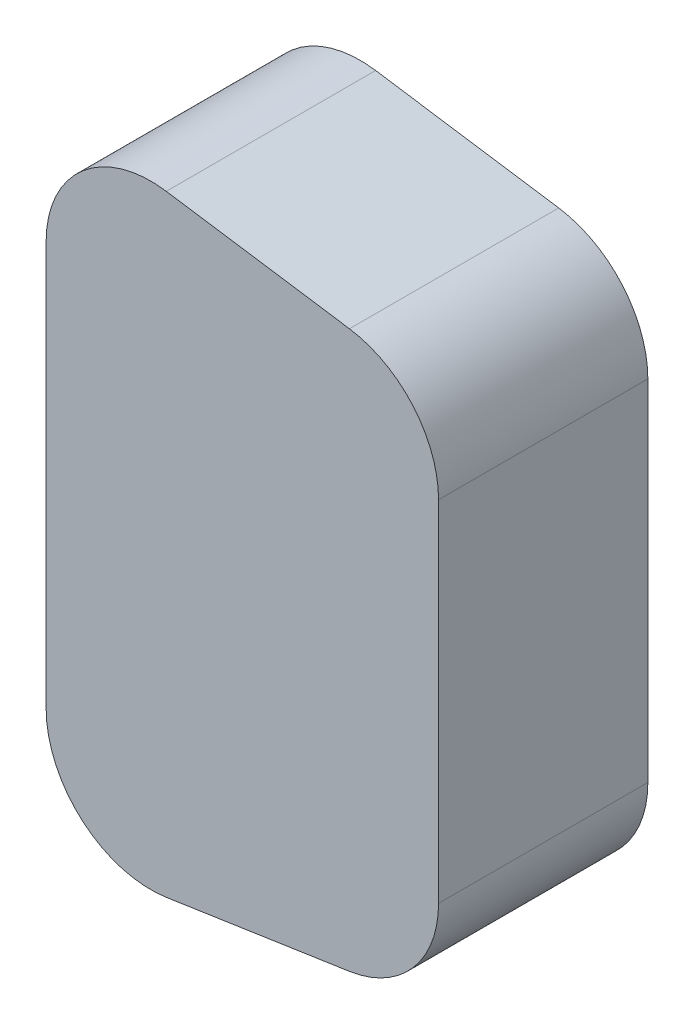
ISO-10303-21;
HEADER;
FILE_DESCRIPTION(('STEP AP214'),'2;1');
FILE_NAME('part.step','',(''),(''),'','','');
FILE_SCHEMA(('AUTOMOTIVE_DESIGN { 1 0 10303 214 1 1 1 1 }'));
ENDSEC;
DATA;
#1=APPLICATION_CONTEXT('core data for automotive mechanical design processes');
#2=APPLICATION_PROTOCOL_DEFINITION('international standard','automotive_design',2000,#1);
#3=PRODUCT_CONTEXT('',#1,'mechanical');
#4=PRODUCT('Part','Part','',(#3));
#5=PRODUCT_RELATED_PRODUCT_CATEGORY('part','',(#4));
#6=PRODUCT_DEFINITION_FORMATION('','',#4);
#7=PRODUCT_DEFINITION_CONTEXT('part definition',#1,'design');
#8=PRODUCT_DEFINITION('design','',#6,#7);
#9=PRODUCT_DEFINITION_SHAPE('','',#8);
#10=(LENGTH_UNIT() NAMED_UNIT(*) SI_UNIT(.MILLI.,.METRE.));
#11=(NAMED_UNIT(*) PLANE_ANGLE_UNIT() SI_UNIT($,.RADIAN.));
#12=(NAMED_UNIT(*) SI_UNIT($,.STERADIAN.) SOLID_ANGLE_UNIT());
#13=UNCERTAINTY_MEASURE_WITH_UNIT(LENGTH_MEASURE(1.E-05),#10,'distance_accuracy_value','');
#14=(GEOMETRIC_REPRESENTATION_CONTEXT(3) GLOBAL_UNCERTAINTY_ASSIGNED_CONTEXT((#13)) GLOBAL_UNIT_ASSIGNED_CONTEXT((#10,
#11,#12)) REPRESENTATION_CONTEXT('',''));
#15=CARTESIAN_POINT('',(0.,0.,0.));
#16=DIRECTION('',(0.,0.,1.));
#17=DIRECTION('',(1.,0.,0.));
#18=AXIS2_PLACEMENT_3D('',#15,#16,#17);
#19=CARTESIAN_POINT('',(10.,-19.3256257919217,20.));
#20=DIRECTION('',(0.,0.,-1.));
#21=DIRECTION('',(-1.,0.,0.));
#22=AXIS2_PLACEMENT_3D('',#19,#20,#21);
#23=CYLINDRICAL_SURFACE('',#22,9.99999999999999);
#24=CARTESIAN_POINT('',(10.,-19.3256257919217,0.));
#25=DIRECTION('',(0.,0.,1.));
#26=DIRECTION('',(1.,0.,0.));
#27=AXIS2_PLACEMENT_3D('',#24,#25,#26);
#28=CIRCLE('',#27,9.99999999999999);
#29=CARTESIAN_POINT('',(0.,-19.3256257919217,0.));
#30=VERTEX_POINT('',#29);
#31=CARTESIAN_POINT('',(11.4834045293024,-29.2149893206046,0.));
#32=VERTEX_POINT('',#31);
#33=EDGE_CURVE('E140',#30,#32,#28,.T.);
#34=ORIENTED_EDGE('',*,*,#33,.T.);
#35=DIRECTION('',(0.,0.,-1.));
#36=VECTOR('',#35,1.);
#37=CARTESIAN_POINT('',(11.4834045293024,-29.2149893206046,20.));
#38=LINE('',#37,#36);
#39=CARTESIAN_POINT('',(11.4834045293024,-29.2149893206046,20.));
#40=VERTEX_POINT('',#39);
#41=EDGE_CURVE('E11',#40,#32,#38,.T.);
#42=ORIENTED_EDGE('',*,*,#41,.F.);
#43=CARTESIAN_POINT('',(10.,-19.3256257919217,20.));
#44=DIRECTION('',(0.,0.,1.));
#45=DIRECTION('',(1.,0.,0.));
#46=AXIS2_PLACEMENT_3D('',#43,#44,#45);
#47=CIRCLE('',#46,9.99999999999999);
#48=CARTESIAN_POINT('',(0.,-19.3256257919217,20.));
#49=VERTEX_POINT('',#48);
#50=EDGE_CURVE('E156',#49,#40,#47,.T.);
#51=ORIENTED_EDGE('',*,*,#50,.F.);
#52=DIRECTION('',(0.,0.,-1.));
#53=VECTOR('',#52,1.);
#54=CARTESIAN_POINT('',(0.,-19.3256257919217,20.));
#55=LINE('',#54,#53);
#56=EDGE_CURVE('E136',#49,#30,#55,.T.);
#57=ORIENTED_EDGE('',*,*,#56,.T.);
#58=EDGE_LOOP('',(#34,#42,#51,#57));
#59=FACE_BOUND('',#58,.T.);
#60=ADVANCED_FACE('F32',(#59),#23,.T.);
#61=CARTESIAN_POINT('',(28.9834045293025,-26.5899893206046,20.));
#62=DIRECTION('',(-0.148340452930245,0.988936352868298,0.));
#63=DIRECTION('',(-0.988936352868298,-0.148340452930245,0.));
#64=AXIS2_PLACEMENT_3D('',#61,#62,#63);
#65=PLANE('',#64);
#66=DIRECTION('',(0.988936352868298,0.148340452930245,0.));
#67=VECTOR('',#66,1.);
#68=CARTESIAN_POINT('',(28.9834045293025,-26.5899893206046,0.));
#69=LINE('',#68,#67);
#70=CARTESIAN_POINT('',(28.9834045293024,-26.5899893206046,0.));
#71=VERTEX_POINT('',#70);
#72=EDGE_CURVE('E143',#32,#71,#69,.T.);
#73=ORIENTED_EDGE('',*,*,#72,.T.);
#74=DIRECTION('',(0.,0.,-1.));
#75=VECTOR('',#74,1.);
#76=CARTESIAN_POINT('',(28.9834045293024,-26.5899893206046,20.));
#77=LINE('',#76,#75);
#78=CARTESIAN_POINT('',(28.9834045293024,-26.5899893206046,20.));
#79=VERTEX_POINT('',#78);
#80=EDGE_CURVE('E39',#79,#71,#77,.T.);
#81=ORIENTED_EDGE('',*,*,#80,.F.);
#82=DIRECTION('',(0.988936352868298,0.148340452930245,0.));
#83=VECTOR('',#82,1.);
#84=CARTESIAN_POINT('',(28.9834045293025,-26.5899893206046,20.));
#85=LINE('',#84,#83);
#86=EDGE_CURVE('E96',#40,#79,#85,.T.);
#87=ORIENTED_EDGE('',*,*,#86,.F.);
#88=ORIENTED_EDGE('',*,*,#41,.T.);
#89=EDGE_LOOP('',(#73,#81,#87,#88));
#90=FACE_BOUND('',#89,.T.);
#91=ADVANCED_FACE('F275',(#90),#65,.F.);
#92=CARTESIAN_POINT('',(27.5,-16.7006257919217,20.));
#93=DIRECTION('',(0.,0.,-1.));
#94=DIRECTION('',(-1.,0.,0.));
#95=AXIS2_PLACEMENT_3D('',#92,#93,#94);
#96=CYLINDRICAL_SURFACE('',#95,10.);
#97=CARTESIAN_POINT('',(27.5,-16.7006257919217,0.));
#98=DIRECTION('',(0.,0.,1.));
#99=DIRECTION('',(1.,0.,0.));
#100=AXIS2_PLACEMENT_3D('',#97,#98,#99);
#101=CIRCLE('',#100,10.);
#102=CARTESIAN_POINT('',(37.5,-16.7006257919217,0.));
#103=VERTEX_POINT('',#102);
#104=EDGE_CURVE('E146',#71,#103,#101,.T.);
#105=ORIENTED_EDGE('',*,*,#104,.T.);
#106=DIRECTION('',(0.,0.,-1.));
#107=VECTOR('',#106,1.);
#108=CARTESIAN_POINT('',(37.5,-16.7006257919217,20.));
#109=LINE('',#108,#107);
#110=CARTESIAN_POINT('',(37.5,-16.7006257919217,20.));
#111=VERTEX_POINT('',#110);
#112=EDGE_CURVE('E163',#111,#103,#109,.T.);
#113=ORIENTED_EDGE('',*,*,#112,.F.);
#114=CARTESIAN_POINT('',(27.5,-16.7006257919217,20.));
#115=DIRECTION('',(0.,0.,1.));
#116=DIRECTION('',(1.,0.,0.));
#117=AXIS2_PLACEMENT_3D('',#114,#115,#116);
#118=CIRCLE('',#117,10.);
#119=EDGE_CURVE('E171',#79,#111,#118,.T.);
#120=ORIENTED_EDGE('',*,*,#119,.F.);
#121=ORIENTED_EDGE('',*,*,#80,.T.);
#122=EDGE_LOOP('',(#105,#113,#120,#121));
#123=FACE_BOUND('',#122,.T.);
#124=ADVANCED_FACE('F169',(#123),#96,.T.);
#125=CARTESIAN_POINT('',(37.5,-16.7006257919217,20.));
#126=DIRECTION('',(-1.,0.,0.));
#127=DIRECTION('',(0.,0.,1.));
#128=AXIS2_PLACEMENT_3D('',#125,#126,#127);
#129=PLANE('',#128);
#130=DIRECTION('',(0.,1.,0.));
#131=VECTOR('',#130,1.);
#132=CARTESIAN_POINT('',(37.5,-16.7006257919217,0.));
#133=LINE('',#132,#131);
#134=CARTESIAN_POINT('',(37.5,16.7006257919217,0.));
#135=VERTEX_POINT('',#134);
#136=EDGE_CURVE('E148',#103,#135,#133,.T.);
#137=ORIENTED_EDGE('',*,*,#136,.T.);
#138=DIRECTION('',(0.,0.,-1.));
#139=VECTOR('',#138,1.);
#140=CARTESIAN_POINT('',(37.5,16.7006257919217,20.));
#141=LINE('',#140,#139);
#142=CARTESIAN_POINT('',(37.5,16.7006257919217,20.));
#143=VERTEX_POINT('',#142);
#144=EDGE_CURVE('E160',#143,#135,#141,.T.);
#145=ORIENTED_EDGE('',*,*,#144,.F.);
#146=DIRECTION('',(0.,1.,0.));
#147=VECTOR('',#146,1.);
#148=CARTESIAN_POINT('',(37.5,-16.7006257919217,20.));
#149=LINE('',#148,#147);
#150=EDGE_CURVE('E183',#111,#143,#149,.T.);
#151=ORIENTED_EDGE('',*,*,#150,.F.);
#152=ORIENTED_EDGE('',*,*,#112,.T.);
#153=EDGE_LOOP('',(#137,#145,#151,#152));
#154=FACE_BOUND('',#153,.T.);
#155=ADVANCED_FACE('F179',(#154),#129,.F.);
#156=CARTESIAN_POINT('',(27.5,16.7006257919217,20.));
#157=DIRECTION('',(0.,0.,-1.));
#158=DIRECTION('',(-1.,0.,0.));
#159=AXIS2_PLACEMENT_3D('',#156,#157,#158);
#160=CYLINDRICAL_SURFACE('',#159,10.);
#161=CARTESIAN_POINT('',(27.5,16.7006257919217,0.));
#162=DIRECTION('',(0.,0.,1.));
#163=DIRECTION('',(-1.,0.,0.));
#164=AXIS2_PLACEMENT_3D('',#161,#162,#163);
#165=CIRCLE('',#164,10.);
#166=CARTESIAN_POINT('',(28.9834045293024,26.5899893206046,0.));
#167=VERTEX_POINT('',#166);
#168=EDGE_CURVE('E150',#135,#167,#165,.T.);
#169=ORIENTED_EDGE('',*,*,#168,.T.);
#170=DIRECTION('',(0.,0.,-1.));
#171=VECTOR('',#170,1.);
#172=CARTESIAN_POINT('',(28.9834045293024,26.5899893206046,20.));
#173=LINE('',#172,#171);
#174=CARTESIAN_POINT('',(28.9834045293024,26.5899893206046,20.));
#175=VERTEX_POINT('',#174);
#176=EDGE_CURVE('E131',#175,#167,#173,.T.);
#177=ORIENTED_EDGE('',*,*,#176,.F.);
#178=CARTESIAN_POINT('',(27.5,16.7006257919217,20.));
#179=DIRECTION('',(0.,0.,1.));
#180=DIRECTION('',(-1.,0.,0.));
#181=AXIS2_PLACEMENT_3D('',#178,#179,#180);
#182=CIRCLE('',#181,10.);
#183=EDGE_CURVE('E119',#143,#175,#182,.T.);
#184=ORIENTED_EDGE('',*,*,#183,.F.);
#185=ORIENTED_EDGE('',*,*,#144,.T.);
#186=EDGE_LOOP('',(#169,#177,#184,#185));
#187=FACE_BOUND('',#186,.T.);
#188=ADVANCED_FACE('F182',(#187),#160,.T.);
#189=CARTESIAN_POINT('',(11.4834045293024,29.2149893206046,20.));
#190=DIRECTION('',(-0.148340452930244,-0.988936352868298,0.));
#191=DIRECTION('',(0.988936352868298,-0.148340452930244,0.));
#192=AXIS2_PLACEMENT_3D('',#189,#190,#191);
#193=PLANE('',#192);
#194=DIRECTION('',(-0.988936352868298,0.148340452930244,0.));
#195=VECTOR('',#194,1.);
#196=CARTESIAN_POINT('',(11.4834045293024,29.2149893206046,0.));
#197=LINE('',#196,#195);
#198=CARTESIAN_POINT('',(11.4834045293024,29.2149893206046,0.));
#199=VERTEX_POINT('',#198);
#200=EDGE_CURVE('E128',#167,#199,#197,.T.);
#201=ORIENTED_EDGE('',*,*,#200,.T.);
#202=DIRECTION('',(0.,0.,-1.));
#203=VECTOR('',#202,1.);
#204=CARTESIAN_POINT('',(11.4834045293024,29.2149893206046,20.));
#205=LINE('',#204,#203);
#206=CARTESIAN_POINT('',(11.4834045293024,29.2149893206046,20.));
#207=VERTEX_POINT('',#206);
#208=EDGE_CURVE('E125',#207,#199,#205,.T.);
#209=ORIENTED_EDGE('',*,*,#208,.F.);
#210=DIRECTION('',(-0.988936352868298,0.148340452930244,0.));
#211=VECTOR('',#210,1.);
#212=CARTESIAN_POINT('',(11.4834045293024,29.2149893206046,20.));
#213=LINE('',#212,#211);
#214=EDGE_CURVE('E112',#175,#207,#213,.T.);
#215=ORIENTED_EDGE('',*,*,#214,.F.);
#216=ORIENTED_EDGE('',*,*,#176,.T.);
#217=EDGE_LOOP('',(#201,#209,#215,#216));
#218=FACE_BOUND('',#217,.T.);
#219=ADVANCED_FACE('F126',(#218),#193,.F.);
#220=CARTESIAN_POINT('',(10.,19.3256257919216,20.));
#221=DIRECTION('',(0.,0.,-1.));
#222=DIRECTION('',(-1.,0.,0.));
#223=AXIS2_PLACEMENT_3D('',#220,#221,#222);
#224=CYLINDRICAL_SURFACE('',#223,10.);
#225=CARTESIAN_POINT('',(10.,19.3256257919216,0.));
#226=DIRECTION('',(0.,0.,1.));
#227=DIRECTION('',(-1.,0.,0.));
#228=AXIS2_PLACEMENT_3D('',#225,#226,#227);
#229=CIRCLE('',#228,10.);
#230=CARTESIAN_POINT('',(0.,19.3256257919216,0.));
#231=VERTEX_POINT('',#230);
#232=EDGE_CURVE('E153',#199,#231,#229,.T.);
#233=ORIENTED_EDGE('',*,*,#232,.T.);
#234=DIRECTION('',(0.,0.,-1.));
#235=VECTOR('',#234,1.);
#236=CARTESIAN_POINT('',(0.,19.3256257919216,20.));
#237=LINE('',#236,#235);
#238=CARTESIAN_POINT('',(0.,19.3256257919216,20.));
#239=VERTEX_POINT('',#238);
#240=EDGE_CURVE('E132',#239,#231,#237,.T.);
#241=ORIENTED_EDGE('',*,*,#240,.F.);
#242=CARTESIAN_POINT('',(10.,19.3256257919216,20.));
#243=DIRECTION('',(0.,0.,1.));
#244=DIRECTION('',(-1.,0.,0.));
#245=AXIS2_PLACEMENT_3D('',#242,#243,#244);
#246=CIRCLE('',#245,10.);
#247=EDGE_CURVE('E116',#207,#239,#246,.T.);
#248=ORIENTED_EDGE('',*,*,#247,.F.);
#249=ORIENTED_EDGE('',*,*,#208,.T.);
#250=EDGE_LOOP('',(#233,#241,#248,#249));
#251=FACE_BOUND('',#250,.T.);
#252=ADVANCED_FACE('F134',(#251),#224,.T.);
#253=CARTESIAN_POINT('',(0.,19.3256257919216,20.));
#254=DIRECTION('',(1.,0.,0.));
#255=DIRECTION('',(0.,1.,0.));
#256=AXIS2_PLACEMENT_3D('',#253,#254,#255);
#257=PLANE('',#256);
#258=DIRECTION('',(0.,0.,1.));
#259=VECTOR('',#258,1.);
#260=CARTESIAN_POINT('',(0.,15.842836282418,5.49999999999999));
#261=LINE('',#260,#259);
#262=CARTESIAN_POINT('',(0.,15.842836282418,5.49999999999999));
#263=VERTEX_POINT('',#262);
#264=CARTESIAN_POINT('',(0.,15.842836282418,14.5));
#265=VERTEX_POINT('',#264);
#266=EDGE_CURVE('E206',#263,#265,#261,.T.);
#267=ORIENTED_EDGE('',*,*,#266,.F.);
#268=DIRECTION('',(0.,-1.,0.));
#269=VECTOR('',#268,1.);
#270=CARTESIAN_POINT('',(0.,15.842836282418,5.49999999999999));
#271=LINE('',#270,#269);
#272=CARTESIAN_POINT('',(0.,17.2971084456427,5.49999999999999));
#273=VERTEX_POINT('',#272);
#274=EDGE_CURVE('E46',#273,#263,#271,.T.);
#275=ORIENTED_EDGE('',*,*,#274,.F.);
#276=DIRECTION('',(0.,0.,-1.));
#277=VECTOR('',#276,1.);
#278=CARTESIAN_POINT('',(0.,17.2971084456427,5.49999999999999));
#279=LINE('',#278,#277);
#280=CARTESIAN_POINT('',(0.,17.2971084456427,14.5));
#281=VERTEX_POINT('',#280);
#282=EDGE_CURVE('E199',#281,#273,#279,.T.);
#283=ORIENTED_EDGE('',*,*,#282,.F.);
#284=DIRECTION('',(0.,1.,0.));
#285=VECTOR('',#284,1.);
#286=CARTESIAN_POINT('',(0.,17.2971084456427,14.5));
#287=LINE('',#286,#285);
#288=EDGE_CURVE('E203',#265,#281,#287,.T.);
#289=ORIENTED_EDGE('',*,*,#288,.F.);
#290=EDGE_LOOP('',(#267,#275,#283,#289));
#291=FACE_BOUND('',#290,.T.);
#292=DIRECTION('',(0.,-1.,0.));
#293=VECTOR('',#292,1.);
#294=CARTESIAN_POINT('',(0.,19.3256257919216,0.));
#295=LINE('',#294,#293);
#296=EDGE_CURVE('E88',#231,#30,#295,.T.);
#297=ORIENTED_EDGE('',*,*,#296,.T.);
#298=ORIENTED_EDGE('',*,*,#56,.F.);
#299=DIRECTION('',(0.,-1.,0.));
#300=VECTOR('',#299,1.);
#301=CARTESIAN_POINT('',(0.,19.3256257919216,20.));
#302=LINE('',#301,#300);
#303=EDGE_CURVE('E55',#239,#49,#302,.T.);
#304=ORIENTED_EDGE('',*,*,#303,.F.);
#305=ORIENTED_EDGE('',*,*,#240,.T.);
#306=EDGE_LOOP('',(#297,#298,#304,#305));
#307=FACE_BOUND('',#306,.T.);
#308=ADVANCED_FACE('F252',(#291,#307),#257,.F.);
#309=CARTESIAN_POINT('',(10.,-19.3256257919217,20.));
#310=DIRECTION('',(0.,0.,1.));
#311=DIRECTION('',(1.,0.,0.));
#312=AXIS2_PLACEMENT_3D('',#309,#310,#311);
#313=PLANE('',#312);
#314=ORIENTED_EDGE('',*,*,#50,.T.);
#315=ORIENTED_EDGE('',*,*,#86,.T.);
#316=ORIENTED_EDGE('',*,*,#119,.T.);
#317=ORIENTED_EDGE('',*,*,#150,.T.);
#318=ORIENTED_EDGE('',*,*,#183,.T.);
#319=ORIENTED_EDGE('',*,*,#214,.T.);
#320=ORIENTED_EDGE('',*,*,#247,.T.);
#321=ORIENTED_EDGE('',*,*,#303,.T.);
#322=EDGE_LOOP('',(#314,#315,#316,#317,#318,#319,#320,#321));
#323=FACE_BOUND('',#322,.T.);
#324=ADVANCED_FACE('F114',(#323),#313,.T.);
#325=CARTESIAN_POINT('',(10.,-19.3256257919217,0.));
#326=DIRECTION('',(0.,0.,1.));
#327=DIRECTION('',(1.,0.,0.));
#328=AXIS2_PLACEMENT_3D('',#325,#326,#327);
#329=PLANE('',#328);
#330=ORIENTED_EDGE('',*,*,#33,.F.);
#331=ORIENTED_EDGE('',*,*,#296,.F.);
#332=ORIENTED_EDGE('',*,*,#232,.F.);
#333=ORIENTED_EDGE('',*,*,#200,.F.);
#334=ORIENTED_EDGE('',*,*,#168,.F.);
#335=ORIENTED_EDGE('',*,*,#136,.F.);
#336=ORIENTED_EDGE('',*,*,#104,.F.);
#337=ORIENTED_EDGE('',*,*,#72,.F.);
#338=EDGE_LOOP('',(#330,#331,#332,#333,#334,#335,#336,#337));
#339=FACE_BOUND('',#338,.T.);
#340=ADVANCED_FACE('F175',(#339),#329,.F.);
#341=CARTESIAN_POINT('',(10.,15.842836282418,5.49999999999999));
#342=DIRECTION('',(0.,0.,-1.));
#343=DIRECTION('',(-1.,0.,0.));
#344=AXIS2_PLACEMENT_3D('',#341,#342,#343);
#345=PLANE('',#344);
#346=ORIENTED_EDGE('',*,*,#274,.T.);
#347=DIRECTION('',(-1.,0.,0.));
#348=VECTOR('',#347,1.);
#349=CARTESIAN_POINT('',(10.,15.842836282418,5.49999999999999));
#350=LINE('',#349,#348);
#351=CARTESIAN_POINT('',(10.,15.842836282418,5.49999999999999));
#352=VERTEX_POINT('',#351);
#353=EDGE_CURVE('E189',#352,#263,#350,.T.);
#354=ORIENTED_EDGE('',*,*,#353,.F.);
#355=DIRECTION('',(0.,-1.,0.));
#356=VECTOR('',#355,1.);
#357=CARTESIAN_POINT('',(10.,15.842836282418,5.49999999999999));
#358=LINE('',#357,#356);
#359=CARTESIAN_POINT('',(10.,17.2971084456427,5.49999999999999));
#360=VERTEX_POINT('',#359);
#361=EDGE_CURVE('E202',#360,#352,#358,.T.);
#362=ORIENTED_EDGE('',*,*,#361,.F.);
#363=DIRECTION('',(-1.,0.,0.));
#364=VECTOR('',#363,1.);
#365=CARTESIAN_POINT('',(10.,17.2971084456427,5.49999999999999));
#366=LINE('',#365,#364);
#367=EDGE_CURVE('E144',#360,#273,#366,.T.);
#368=ORIENTED_EDGE('',*,*,#367,.T.);
#369=EDGE_LOOP('',(#346,#354,#362,#368));
#370=FACE_BOUND('',#369,.T.);
#371=ADVANCED_FACE('F240',(#370),#345,.F.);
#372=CARTESIAN_POINT('',(10.,17.2971084456427,5.49999999999999));
#373=DIRECTION('',(0.,1.,0.));
#374=DIRECTION('',(0.,0.,1.));
#375=AXIS2_PLACEMENT_3D('',#372,#373,#374);
#376=PLANE('',#375);
#377=CARTESIAN_POINT('',(2.64487157528492,17.2971084456427,9.99999999999999));
#378=DIRECTION('',(0.,-1.,0.));
#379=DIRECTION('',(0.,0.,-1.));
#380=AXIS2_PLACEMENT_3D('',#377,#378,#379);
#381=CIRCLE('',#380,0.5);
#382=CARTESIAN_POINT('',(2.64487157528492,17.2971084456427,9.49999999999999));
#383=VERTEX_POINT('',#382);
#384=EDGE_CURVE('E221',#383,#383,#381,.T.);
#385=ORIENTED_EDGE('',*,*,#384,.F.);
#386=EDGE_LOOP('',(#385));
#387=FACE_BOUND('',#386,.T.);
#388=ORIENTED_EDGE('',*,*,#282,.T.);
#389=ORIENTED_EDGE('',*,*,#367,.F.);
#390=DIRECTION('',(0.,0.,-1.));
#391=VECTOR('',#390,1.);
#392=CARTESIAN_POINT('',(10.,17.2971084456427,5.49999999999999));
#393=LINE('',#392,#391);
#394=CARTESIAN_POINT('',(10.,17.2971084456427,14.5));
#395=VERTEX_POINT('',#394);
#396=EDGE_CURVE('E192',#395,#360,#393,.T.);
#397=ORIENTED_EDGE('',*,*,#396,.F.);
#398=DIRECTION('',(-1.,0.,0.));
#399=VECTOR('',#398,1.);
#400=CARTESIAN_POINT('',(10.,17.2971084456427,14.5));
#401=LINE('',#400,#399);
#402=EDGE_CURVE('E195',#395,#281,#401,.T.);
#403=ORIENTED_EDGE('',*,*,#402,.T.);
#404=EDGE_LOOP('',(#388,#389,#397,#403));
#405=FACE_BOUND('',#404,.T.);
#406=ADVANCED_FACE('F236',(#387,#405),#376,.F.);
#407=CARTESIAN_POINT('',(10.,17.2971084456427,14.5));
#408=DIRECTION('',(0.,0.,1.));
#409=DIRECTION('',(1.,0.,0.));
#410=AXIS2_PLACEMENT_3D('',#407,#408,#409);
#411=PLANE('',#410);
#412=ORIENTED_EDGE('',*,*,#288,.T.);
#413=ORIENTED_EDGE('',*,*,#402,.F.);
#414=DIRECTION('',(0.,1.,0.));
#415=VECTOR('',#414,1.);
#416=CARTESIAN_POINT('',(10.,17.2971084456427,14.5));
#417=LINE('',#416,#415);
#418=CARTESIAN_POINT('',(10.,15.842836282418,14.5));
#419=VERTEX_POINT('',#418);
#420=EDGE_CURVE('E213',#419,#395,#417,.T.);
#421=ORIENTED_EDGE('',*,*,#420,.F.);
#422=DIRECTION('',(-1.,0.,0.));
#423=VECTOR('',#422,1.);
#424=CARTESIAN_POINT('',(10.,15.842836282418,14.5));
#425=LINE('',#424,#423);
#426=EDGE_CURVE('E191',#419,#265,#425,.T.);
#427=ORIENTED_EDGE('',*,*,#426,.T.);
#428=EDGE_LOOP('',(#412,#413,#421,#427));
#429=FACE_BOUND('',#428,.T.);
#430=ADVANCED_FACE('F239',(#429),#411,.F.);
#431=CARTESIAN_POINT('',(10.,15.842836282418,5.49999999999999));
#432=DIRECTION('',(0.,-1.,0.));
#433=DIRECTION('',(0.,0.,-1.));
#434=AXIS2_PLACEMENT_3D('',#431,#432,#433);
#435=PLANE('',#434);
#436=ORIENTED_EDGE('',*,*,#266,.T.);
#437=ORIENTED_EDGE('',*,*,#426,.F.);
#438=DIRECTION('',(0.,0.,1.));
#439=VECTOR('',#438,1.);
#440=CARTESIAN_POINT('',(10.,15.842836282418,5.49999999999999));
#441=LINE('',#440,#439);
#442=EDGE_CURVE('E216',#352,#419,#441,.T.);
#443=ORIENTED_EDGE('',*,*,#442,.F.);
#444=ORIENTED_EDGE('',*,*,#353,.T.);
#445=EDGE_LOOP('',(#436,#437,#443,#444));
#446=FACE_BOUND('',#445,.T.);
#447=ADVANCED_FACE('F256',(#446),#435,.F.);
#448=CARTESIAN_POINT('',(10.,0.,0.));
#449=DIRECTION('',(1.,0.,0.));
#450=DIRECTION('',(0.,0.,-1.));
#451=AXIS2_PLACEMENT_3D('',#448,#449,#450);
#452=PLANE('',#451);
#453=ORIENTED_EDGE('',*,*,#361,.T.);
#454=ORIENTED_EDGE('',*,*,#442,.T.);
#455=ORIENTED_EDGE('',*,*,#420,.T.);
#456=ORIENTED_EDGE('',*,*,#396,.T.);
#457=EDGE_LOOP('',(#453,#454,#455,#456));
#458=FACE_BOUND('',#457,.T.);
#459=ADVANCED_FACE('F232',(#458),#452,.F.);
#460=CARTESIAN_POINT('',(2.64487157528492,22.2971084456427,9.99999999999999));
#461=DIRECTION('',(0.,-1.,0.));
#462=DIRECTION('',(0.,0.,-1.));
#463=AXIS2_PLACEMENT_3D('',#460,#461,#462);
#464=CYLINDRICAL_SURFACE('',#463,0.5);
#465=CARTESIAN_POINT('',(2.64487157528492,22.2971084456427,9.99999999999999));
#466=DIRECTION('',(0.,-1.,0.));
#467=DIRECTION('',(0.,0.,-1.));
#468=AXIS2_PLACEMENT_3D('',#465,#466,#467);
#469=CIRCLE('',#468,0.5);
#470=CARTESIAN_POINT('',(2.64487157528492,22.2971084456427,9.49999999999999));
#471=VERTEX_POINT('',#470);
#472=EDGE_CURVE('E210',#471,#471,#469,.T.);
#473=ORIENTED_EDGE('',*,*,#472,.F.);
#474=EDGE_LOOP('',(#473));
#475=FACE_BOUND('',#474,.T.);
#476=ORIENTED_EDGE('',*,*,#384,.T.);
#477=EDGE_LOOP('',(#476));
#478=FACE_BOUND('',#477,.T.);
#479=ADVANCED_FACE('F229',(#475,#478),#464,.F.);
#480=CARTESIAN_POINT('',(2.64487157528492,22.2971084456427,9.99999999999999));
#481=DIRECTION('',(0.,-1.,0.));
#482=DIRECTION('',(0.,0.,-1.));
#483=AXIS2_PLACEMENT_3D('',#480,#481,#482);
#484=PLANE('',#483);
#485=ORIENTED_EDGE('',*,*,#472,.T.);
#486=EDGE_LOOP('',(#485));
#487=FACE_BOUND('',#486,.T.);
#488=ADVANCED_FACE('F227',(#487),#484,.T.);
#489=CLOSED_SHELL('',(#60,#91,#124,#155,#188,#219,#252,#308,#324,#340,#371,#406,#430,#447,#459,
#479,#488));
#490=MANIFOLD_SOLID_BREP('B2',#489);
#491=ADVANCED_BREP_SHAPE_REPRESENTATION('',(#18,#490),#14);
#492=SHAPE_DEFINITION_REPRESENTATION(#9,#491);
ENDSEC;
END-ISO-10303-21;
